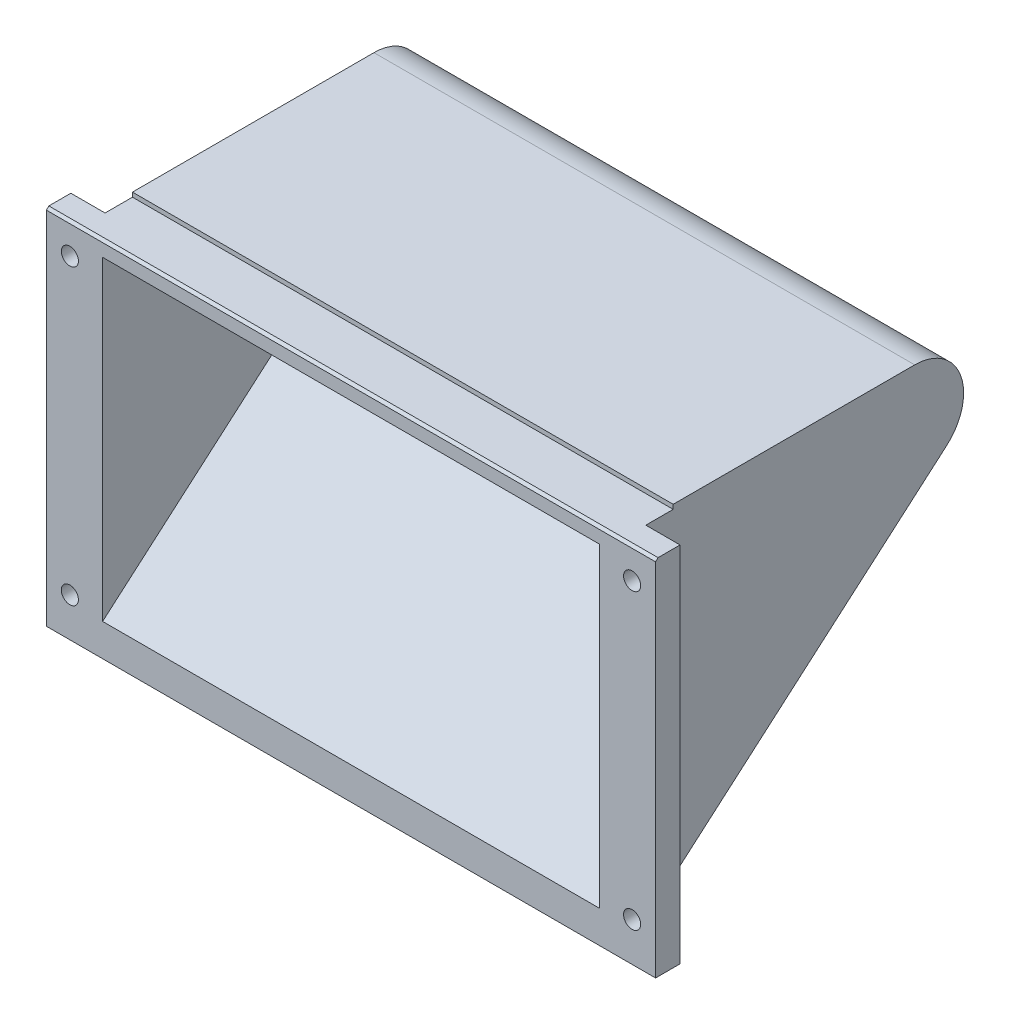
ISO-10303-21;
HEADER;
FILE_DESCRIPTION(('STEP AP214'),'2;1');
FILE_NAME('part.step','',(''),(''),'','','');
FILE_SCHEMA(('AUTOMOTIVE_DESIGN { 1 0 10303 214 1 1 1 1 }'));
ENDSEC;
DATA;
#1=APPLICATION_CONTEXT('core data for automotive mechanical design processes');
#2=APPLICATION_PROTOCOL_DEFINITION('international standard','automotive_design',2000,#1);
#3=PRODUCT_CONTEXT('',#1,'mechanical');
#4=PRODUCT('Part','Part','',(#3));
#5=PRODUCT_RELATED_PRODUCT_CATEGORY('part','',(#4));
#6=PRODUCT_DEFINITION_FORMATION('','',#4);
#7=PRODUCT_DEFINITION_CONTEXT('part definition',#1,'design');
#8=PRODUCT_DEFINITION('design','',#6,#7);
#9=PRODUCT_DEFINITION_SHAPE('','',#8);
#10=(LENGTH_UNIT() NAMED_UNIT(*) SI_UNIT(.MILLI.,.METRE.));
#11=(NAMED_UNIT(*) PLANE_ANGLE_UNIT() SI_UNIT($,.RADIAN.));
#12=(NAMED_UNIT(*) SI_UNIT($,.STERADIAN.) SOLID_ANGLE_UNIT());
#13=UNCERTAINTY_MEASURE_WITH_UNIT(LENGTH_MEASURE(1.E-05),#10,'distance_accuracy_value','');
#14=(GEOMETRIC_REPRESENTATION_CONTEXT(3) GLOBAL_UNCERTAINTY_ASSIGNED_CONTEXT((#13)) GLOBAL_UNIT_ASSIGNED_CONTEXT((#10,
#11,#12)) REPRESENTATION_CONTEXT('',''));
#15=CARTESIAN_POINT('',(0.,0.,0.));
#16=DIRECTION('',(0.,0.,1.));
#17=DIRECTION('',(1.,0.,0.));
#18=AXIS2_PLACEMENT_3D('',#15,#16,#17);
#19=CARTESIAN_POINT('',(50.8,5.,0.));
#20=DIRECTION('',(0.,-1.,0.));
#21=DIRECTION('',(0.,0.,-1.));
#22=AXIS2_PLACEMENT_3D('',#19,#20,#21);
#23=PLANE('',#22);
#24=DIRECTION('',(-1.,0.,0.));
#25=VECTOR('',#24,1.);
#26=CARTESIAN_POINT('',(-62.3,5.,-10.6));
#27=LINE('',#26,#25);
#28=CARTESIAN_POINT('',(55.3,5.,-10.6));
#29=VERTEX_POINT('',#28);
#30=CARTESIAN_POINT('',(-55.3,5.,-10.6));
#31=VERTEX_POINT('',#30);
#32=EDGE_CURVE('E192',#29,#31,#27,.T.);
#33=ORIENTED_EDGE('',*,*,#32,.F.);
#34=DIRECTION('',(0.,0.,1.));
#35=VECTOR('',#34,1.);
#36=CARTESIAN_POINT('',(55.3,5.,0.));
#37=LINE('',#36,#35);
#38=CARTESIAN_POINT('',(55.3,5.,-60.));
#39=VERTEX_POINT('',#38);
#40=EDGE_CURVE('E233',#39,#29,#37,.T.);
#41=ORIENTED_EDGE('',*,*,#40,.F.);
#42=DIRECTION('',(-1.,0.,0.));
#43=VECTOR('',#42,1.);
#44=CARTESIAN_POINT('',(50.8,5.00000000000001,-60.));
#45=LINE('',#44,#43);
#46=CARTESIAN_POINT('',(-55.3,5.,-60.));
#47=VERTEX_POINT('',#46);
#48=EDGE_CURVE('E258',#39,#47,#45,.T.);
#49=ORIENTED_EDGE('',*,*,#48,.T.);
#50=DIRECTION('',(0.,0.,1.));
#51=VECTOR('',#50,1.);
#52=CARTESIAN_POINT('',(-55.3,5.,0.));
#53=LINE('',#52,#51);
#54=EDGE_CURVE('E220',#47,#31,#53,.T.);
#55=ORIENTED_EDGE('',*,*,#54,.T.);
#56=EDGE_LOOP('',(#33,#41,#49,#55));
#57=FACE_BOUND('',#56,.T.);
#58=ADVANCED_FACE('F43',(#57),#23,.F.);
#59=CARTESIAN_POINT('',(50.8,-12.5637779895862,-66.5413502065132));
#60=DIRECTION('',(0.,0.756377798958623,0.654135020651324));
#61=DIRECTION('',(0.,-0.654135020651324,0.756377798958623));
#62=AXIS2_PLACEMENT_3D('',#59,#60,#61);
#63=PLANE('',#62);
#64=DIRECTION('',(1.,0.,0.));
#65=VECTOR('',#64,1.);
#66=CARTESIAN_POINT('',(50.8,-65.7863242405109,-5.));
#67=LINE('',#66,#65);
#68=CARTESIAN_POINT('',(-55.3,-65.7863242405109,-5.));
#69=VERTEX_POINT('',#68);
#70=CARTESIAN_POINT('',(55.3,-65.7863242405109,-5.));
#71=VERTEX_POINT('',#70);
#72=EDGE_CURVE('E214',#69,#71,#67,.T.);
#73=ORIENTED_EDGE('',*,*,#72,.F.);
#74=DIRECTION('',(0.,0.654135020651324,-0.756377798958623));
#75=VECTOR('',#74,1.);
#76=CARTESIAN_POINT('',(-55.3,-40.1107072918938,-34.6887737567738));
#77=LINE('',#76,#75);
#78=CARTESIAN_POINT('',(-55.3,-12.5637779895862,-66.5413502065132));
#79=VERTEX_POINT('',#78);
#80=EDGE_CURVE('E226',#69,#79,#77,.T.);
#81=ORIENTED_EDGE('',*,*,#80,.T.);
#82=DIRECTION('',(-1.,0.,0.));
#83=VECTOR('',#82,1.);
#84=CARTESIAN_POINT('',(50.8,-12.5637779895862,-66.5413502065132));
#85=LINE('',#84,#83);
#86=CARTESIAN_POINT('',(55.3,-12.5637779895862,-66.5413502065132));
#87=VERTEX_POINT('',#86);
#88=EDGE_CURVE('E299',#87,#79,#85,.T.);
#89=ORIENTED_EDGE('',*,*,#88,.F.);
#90=DIRECTION('',(0.,0.654135020651324,-0.756377798958623));
#91=VECTOR('',#90,1.);
#92=CARTESIAN_POINT('',(55.3,-40.1107072918938,-34.6887737567738));
#93=LINE('',#92,#91);
#94=EDGE_CURVE('E236',#71,#87,#93,.T.);
#95=ORIENTED_EDGE('',*,*,#94,.F.);
#96=EDGE_LOOP('',(#73,#81,#89,#95));
#97=FACE_BOUND('',#96,.T.);
#98=ADVANCED_FACE('F401',(#97),#63,.F.);
#99=CARTESIAN_POINT('',(55.3,0.,0.));
#100=DIRECTION('',(1.,0.,0.));
#101=DIRECTION('',(0.,0.,-1.));
#102=AXIS2_PLACEMENT_3D('',#99,#100,#101);
#103=PLANE('',#102);
#104=DIRECTION('',(0.,0.,-1.));
#105=VECTOR('',#104,1.);
#106=CARTESIAN_POINT('',(55.3,4.1,0.));
#107=LINE('',#106,#105);
#108=CARTESIAN_POINT('',(55.3,4.1,-5.));
#109=VERTEX_POINT('',#108);
#110=CARTESIAN_POINT('',(55.3,4.1,-10.6));
#111=VERTEX_POINT('',#110);
#112=EDGE_CURVE('E349',#109,#111,#107,.T.);
#113=ORIENTED_EDGE('',*,*,#112,.F.);
#114=DIRECTION('',(0.,-1.,0.));
#115=VECTOR('',#114,1.);
#116=CARTESIAN_POINT('',(55.3,0.,-5.));
#117=LINE('',#116,#115);
#118=EDGE_CURVE('E217',#109,#71,#117,.T.);
#119=ORIENTED_EDGE('',*,*,#118,.T.);
#120=ORIENTED_EDGE('',*,*,#94,.T.);
#121=CARTESIAN_POINT('',(55.3,-5.,-60.));
#122=DIRECTION('',(1.,0.,0.));
#123=DIRECTION('',(0.,0.,-1.));
#124=AXIS2_PLACEMENT_3D('',#121,#122,#123);
#125=CIRCLE('',#124,10.);
#126=EDGE_CURVE('E238',#87,#39,#125,.T.);
#127=ORIENTED_EDGE('',*,*,#126,.T.);
#128=ORIENTED_EDGE('',*,*,#40,.T.);
#129=DIRECTION('',(0.,-1.,0.));
#130=VECTOR('',#129,1.);
#131=CARTESIAN_POINT('',(55.3,0.,-10.6));
#132=LINE('',#131,#130);
#133=EDGE_CURVE('E359',#29,#111,#132,.T.);
#134=ORIENTED_EDGE('',*,*,#133,.T.);
#135=EDGE_LOOP('',(#113,#119,#120,#127,#128,#134));
#136=FACE_BOUND('',#135,.T.);
#137=ADVANCED_FACE('F407',(#136),#103,.T.);
#138=CARTESIAN_POINT('',(-55.3,0.,0.));
#139=DIRECTION('',(-1.,0.,0.));
#140=DIRECTION('',(0.,0.,-1.));
#141=AXIS2_PLACEMENT_3D('',#138,#139,#140);
#142=PLANE('',#141);
#143=DIRECTION('',(0.,0.,1.));
#144=VECTOR('',#143,1.);
#145=CARTESIAN_POINT('',(-55.3,4.1,0.));
#146=LINE('',#145,#144);
#147=CARTESIAN_POINT('',(-55.3,4.1,-10.6));
#148=VERTEX_POINT('',#147);
#149=CARTESIAN_POINT('',(-55.3,4.1,-5.));
#150=VERTEX_POINT('',#149);
#151=EDGE_CURVE('E175',#148,#150,#146,.T.);
#152=ORIENTED_EDGE('',*,*,#151,.F.);
#153=DIRECTION('',(0.,1.,0.));
#154=VECTOR('',#153,1.);
#155=CARTESIAN_POINT('',(-55.3,0.,-10.6));
#156=LINE('',#155,#154);
#157=EDGE_CURVE('E356',#148,#31,#156,.T.);
#158=ORIENTED_EDGE('',*,*,#157,.T.);
#159=ORIENTED_EDGE('',*,*,#54,.F.);
#160=CARTESIAN_POINT('',(-55.3,-5.,-60.));
#161=DIRECTION('',(1.,0.,0.));
#162=DIRECTION('',(0.,0.,-1.));
#163=AXIS2_PLACEMENT_3D('',#160,#161,#162);
#164=CIRCLE('',#163,10.);
#165=EDGE_CURVE('E223',#79,#47,#164,.T.);
#166=ORIENTED_EDGE('',*,*,#165,.F.);
#167=ORIENTED_EDGE('',*,*,#80,.F.);
#168=DIRECTION('',(0.,1.,0.));
#169=VECTOR('',#168,1.);
#170=CARTESIAN_POINT('',(-55.3,0.,-5.));
#171=LINE('',#170,#169);
#172=EDGE_CURVE('E211',#69,#150,#171,.T.);
#173=ORIENTED_EDGE('',*,*,#172,.T.);
#174=EDGE_LOOP('',(#152,#158,#159,#166,#167,#173));
#175=FACE_BOUND('',#174,.T.);
#176=ADVANCED_FACE('F426',(#175),#142,.T.);
#177=CARTESIAN_POINT('',(50.8,0.,0.));
#178=DIRECTION('',(0.,1.,0.));
#179=DIRECTION('',(0.,0.,1.));
#180=AXIS2_PLACEMENT_3D('',#177,#178,#179);
#181=PLANE('',#180);
#182=DIRECTION('',(0.,0.,-1.));
#183=VECTOR('',#182,1.);
#184=CARTESIAN_POINT('',(50.8,0.,0.));
#185=LINE('',#184,#183);
#186=CARTESIAN_POINT('',(50.8,0.,-5.461));
#187=VERTEX_POINT('',#186);
#188=CARTESIAN_POINT('',(50.8,0.,-60.));
#189=VERTEX_POINT('',#188);
#190=EDGE_CURVE('E250',#187,#189,#185,.T.);
#191=ORIENTED_EDGE('',*,*,#190,.F.);
#192=DIRECTION('',(1.,0.,0.));
#193=VECTOR('',#192,1.);
#194=CARTESIAN_POINT('',(-50.8,0.,-5.461));
#195=LINE('',#194,#193);
#196=CARTESIAN_POINT('',(-50.8,0.,-5.461));
#197=VERTEX_POINT('',#196);
#198=EDGE_CURVE('E364',#197,#187,#195,.T.);
#199=ORIENTED_EDGE('',*,*,#198,.F.);
#200=DIRECTION('',(0.,0.,-1.));
#201=VECTOR('',#200,1.);
#202=CARTESIAN_POINT('',(-50.8,0.,0.));
#203=LINE('',#202,#201);
#204=CARTESIAN_POINT('',(-50.8,0.,-60.));
#205=VERTEX_POINT('',#204);
#206=EDGE_CURVE('E241',#197,#205,#203,.T.);
#207=ORIENTED_EDGE('',*,*,#206,.T.);
#208=DIRECTION('',(-1.,0.,0.));
#209=VECTOR('',#208,1.);
#210=CARTESIAN_POINT('',(50.8,0.,-60.));
#211=LINE('',#210,#209);
#212=EDGE_CURVE('E271',#189,#205,#211,.T.);
#213=ORIENTED_EDGE('',*,*,#212,.F.);
#214=EDGE_LOOP('',(#191,#199,#207,#213));
#215=FACE_BOUND('',#214,.T.);
#216=ADVANCED_FACE('F383',(#215),#181,.F.);
#217=CARTESIAN_POINT('',(50.8,-5.,-60.));
#218=DIRECTION('',(-1.,0.,0.));
#219=DIRECTION('',(0.,0.,1.));
#220=AXIS2_PLACEMENT_3D('',#217,#218,#219);
#221=CYLINDRICAL_SURFACE('',#220,4.99999999999999);
#222=CARTESIAN_POINT('',(-50.8,-5.,-60.));
#223=DIRECTION('',(-1.,0.,0.));
#224=DIRECTION('',(0.,0.,1.));
#225=AXIS2_PLACEMENT_3D('',#222,#223,#224);
#226=CIRCLE('',#225,4.99999999999999);
#227=CARTESIAN_POINT('',(-50.8,-8.78188899479311,-63.2706751032566));
#228=VERTEX_POINT('',#227);
#229=EDGE_CURVE('E253',#205,#228,#226,.T.);
#230=ORIENTED_EDGE('',*,*,#229,.T.);
#231=DIRECTION('',(-1.,0.,0.));
#232=VECTOR('',#231,1.);
#233=CARTESIAN_POINT('',(50.8,-8.78188899479311,-63.2706751032566));
#234=LINE('',#233,#232);
#235=CARTESIAN_POINT('',(50.8,-8.78188899479311,-63.2706751032566));
#236=VERTEX_POINT('',#235);
#237=EDGE_CURVE('E295',#236,#228,#234,.T.);
#238=ORIENTED_EDGE('',*,*,#237,.F.);
#239=CARTESIAN_POINT('',(50.8,-5.,-60.));
#240=DIRECTION('',(-1.,0.,0.));
#241=DIRECTION('',(0.,0.,1.));
#242=AXIS2_PLACEMENT_3D('',#239,#240,#241);
#243=CIRCLE('',#242,4.99999999999999);
#244=EDGE_CURVE('E246',#189,#236,#243,.T.);
#245=ORIENTED_EDGE('',*,*,#244,.F.);
#246=ORIENTED_EDGE('',*,*,#212,.T.);
#247=EDGE_LOOP('',(#230,#238,#245,#246));
#248=FACE_BOUND('',#247,.T.);
#249=ADVANCED_FACE('F387',(#248),#221,.F.);
#250=CARTESIAN_POINT('',(50.8,-8.78188899479311,-63.2706751032566));
#251=DIRECTION('',(0.,-0.756377798958623,-0.654135020651324));
#252=DIRECTION('',(0.,0.654135020651325,-0.756377798958623));
#253=AXIS2_PLACEMENT_3D('',#250,#251,#252);
#254=PLANE('',#253);
#255=DIRECTION('',(0.,-0.654135020651324,0.756377798958623));
#256=VECTOR('',#255,1.);
#257=CARTESIAN_POINT('',(-50.8,-8.78188899479311,-63.2706751032566));
#258=LINE('',#257,#256);
#259=CARTESIAN_POINT('',(-50.8,-63.5,0.));
#260=VERTEX_POINT('',#259);
#261=EDGE_CURVE('E267',#228,#260,#258,.T.);
#262=ORIENTED_EDGE('',*,*,#261,.T.);
#263=DIRECTION('',(-1.,0.,0.));
#264=VECTOR('',#263,1.);
#265=CARTESIAN_POINT('',(50.8,-63.5,0.));
#266=LINE('',#265,#264);
#267=CARTESIAN_POINT('',(50.8,-63.5,0.));
#268=VERTEX_POINT('',#267);
#269=EDGE_CURVE('E292',#268,#260,#266,.T.);
#270=ORIENTED_EDGE('',*,*,#269,.F.);
#271=DIRECTION('',(0.,-0.654135020651324,0.756377798958623));
#272=VECTOR('',#271,1.);
#273=CARTESIAN_POINT('',(50.8,-8.78188899479311,-63.2706751032566));
#274=LINE('',#273,#272);
#275=EDGE_CURVE('E249',#236,#268,#274,.T.);
#276=ORIENTED_EDGE('',*,*,#275,.F.);
#277=ORIENTED_EDGE('',*,*,#237,.T.);
#278=EDGE_LOOP('',(#262,#270,#276,#277));
#279=FACE_BOUND('',#278,.T.);
#280=ADVANCED_FACE('F389',(#279),#254,.F.);
#281=CARTESIAN_POINT('',(50.8,-70.110453145087,0.));
#282=DIRECTION('',(0.,0.,-1.));
#283=DIRECTION('',(0.,1.,0.));
#284=AXIS2_PLACEMENT_3D('',#281,#282,#283);
#285=PLANE('',#284);
#286=CARTESIAN_POINT('',(57.5,-2.14599999999997,0.));
#287=DIRECTION('',(0.,0.,1.));
#288=DIRECTION('',(1.,0.,0.));
#289=AXIS2_PLACEMENT_3D('',#286,#287,#288);
#290=CIRCLE('',#289,1.75);
#291=CARTESIAN_POINT('',(59.25,-2.14599999999997,0.));
#292=VERTEX_POINT('',#291);
#293=EDGE_CURVE('E320',#292,#292,#290,.T.);
#294=ORIENTED_EDGE('',*,*,#293,.F.);
#295=EDGE_LOOP('',(#294));
#296=FACE_BOUND('',#295,.T.);
#297=CARTESIAN_POINT('',(57.5,-62.146,0.));
#298=DIRECTION('',(0.,0.,1.));
#299=DIRECTION('',(1.,0.,0.));
#300=AXIS2_PLACEMENT_3D('',#297,#298,#299);
#301=CIRCLE('',#300,1.75);
#302=CARTESIAN_POINT('',(59.25,-62.146,0.));
#303=VERTEX_POINT('',#302);
#304=EDGE_CURVE('E317',#303,#303,#301,.T.);
#305=ORIENTED_EDGE('',*,*,#304,.F.);
#306=EDGE_LOOP('',(#305));
#307=FACE_BOUND('',#306,.T.);
#308=CARTESIAN_POINT('',(-57.5,-62.146,0.));
#309=DIRECTION('',(0.,0.,1.));
#310=DIRECTION('',(1.,0.,0.));
#311=AXIS2_PLACEMENT_3D('',#308,#309,#310);
#312=CIRCLE('',#311,1.75);
#313=CARTESIAN_POINT('',(-55.75,-62.146,0.));
#314=VERTEX_POINT('',#313);
#315=EDGE_CURVE('E314',#314,#314,#312,.T.);
#316=ORIENTED_EDGE('',*,*,#315,.F.);
#317=EDGE_LOOP('',(#316));
#318=FACE_BOUND('',#317,.T.);
#319=CARTESIAN_POINT('',(-57.5,-2.14599999999998,0.));
#320=DIRECTION('',(0.,0.,1.));
#321=DIRECTION('',(1.,0.,0.));
#322=AXIS2_PLACEMENT_3D('',#319,#320,#321);
#323=CIRCLE('',#322,1.75);
#324=CARTESIAN_POINT('',(-55.75,-2.14599999999998,0.));
#325=VERTEX_POINT('',#324);
#326=EDGE_CURVE('E310',#325,#325,#323,.T.);
#327=ORIENTED_EDGE('',*,*,#326,.F.);
#328=EDGE_LOOP('',(#327));
#329=FACE_BOUND('',#328,.T.);
#330=DIRECTION('',(0.,-1.,0.));
#331=VECTOR('',#330,1.);
#332=CARTESIAN_POINT('',(-50.8,0.,0.));
#333=LINE('',#332,#331);
#334=CARTESIAN_POINT('',(-50.8,1.,0.));
#335=VERTEX_POINT('',#334);
#336=EDGE_CURVE('E219',#335,#260,#333,.T.);
#337=ORIENTED_EDGE('',*,*,#336,.F.);
#338=DIRECTION('',(1.,0.,0.));
#339=VECTOR('',#338,1.);
#340=CARTESIAN_POINT('',(50.8,1.,0.));
#341=LINE('',#340,#339);
#342=CARTESIAN_POINT('',(50.8,1.,0.));
#343=VERTEX_POINT('',#342);
#344=EDGE_CURVE('E275',#335,#343,#341,.T.);
#345=ORIENTED_EDGE('',*,*,#344,.T.);
#346=DIRECTION('',(0.,-1.,0.));
#347=VECTOR('',#346,1.);
#348=CARTESIAN_POINT('',(50.8,0.,0.));
#349=LINE('',#348,#347);
#350=EDGE_CURVE('E228',#343,#268,#349,.T.);
#351=ORIENTED_EDGE('',*,*,#350,.T.);
#352=ORIENTED_EDGE('',*,*,#269,.T.);
#353=EDGE_LOOP('',(#337,#345,#351,#352));
#354=FACE_BOUND('',#353,.T.);
#355=DIRECTION('',(0.,-1.,0.));
#356=VECTOR('',#355,1.);
#357=CARTESIAN_POINT('',(62.3,0.,0.));
#358=LINE('',#357,#356);
#359=CARTESIAN_POINT('',(62.3,3.60000000000001,0.));
#360=VERTEX_POINT('',#359);
#361=CARTESIAN_POINT('',(62.3,-70.110453145087,0.));
#362=VERTEX_POINT('',#361);
#363=EDGE_CURVE('E206',#360,#362,#358,.T.);
#364=ORIENTED_EDGE('',*,*,#363,.F.);
#365=DIRECTION('',(-1.,0.,0.));
#366=VECTOR('',#365,1.);
#367=CARTESIAN_POINT('',(50.8,3.60000000000001,0.));
#368=LINE('',#367,#366);
#369=CARTESIAN_POINT('',(-62.3,3.60000000000001,0.));
#370=VERTEX_POINT('',#369);
#371=EDGE_CURVE('E278',#360,#370,#368,.T.);
#372=ORIENTED_EDGE('',*,*,#371,.T.);
#373=DIRECTION('',(0.,1.,0.));
#374=VECTOR('',#373,1.);
#375=CARTESIAN_POINT('',(-62.3,0.,0.));
#376=LINE('',#375,#374);
#377=CARTESIAN_POINT('',(-62.3,-70.110453145087,0.));
#378=VERTEX_POINT('',#377);
#379=EDGE_CURVE('E208',#378,#370,#376,.T.);
#380=ORIENTED_EDGE('',*,*,#379,.F.);
#381=DIRECTION('',(-1.,0.,0.));
#382=VECTOR('',#381,1.);
#383=CARTESIAN_POINT('',(50.8,-70.110453145087,0.));
#384=LINE('',#383,#382);
#385=EDGE_CURVE('E296',#362,#378,#384,.T.);
#386=ORIENTED_EDGE('',*,*,#385,.F.);
#387=EDGE_LOOP('',(#364,#372,#380,#386));
#388=FACE_BOUND('',#387,.T.);
#389=ADVANCED_FACE('F289',(#296,#307,#318,#329,#354,#388),#285,.F.);
#390=CARTESIAN_POINT('',(50.8,-5.,-60.));
#391=DIRECTION('',(-1.,0.,0.));
#392=DIRECTION('',(0.,0.,1.));
#393=AXIS2_PLACEMENT_3D('',#390,#391,#392);
#394=CYLINDRICAL_SURFACE('',#393,10.);
#395=ORIENTED_EDGE('',*,*,#88,.T.);
#396=ORIENTED_EDGE('',*,*,#165,.T.);
#397=ORIENTED_EDGE('',*,*,#48,.F.);
#398=ORIENTED_EDGE('',*,*,#126,.F.);
#399=EDGE_LOOP('',(#395,#396,#397,#398));
#400=FACE_BOUND('',#399,.T.);
#401=ADVANCED_FACE('F396',(#400),#394,.T.);
#402=CARTESIAN_POINT('',(50.8,0.,0.));
#403=DIRECTION('',(1.,0.,0.));
#404=DIRECTION('',(0.,0.,-1.));
#405=AXIS2_PLACEMENT_3D('',#402,#403,#404);
#406=PLANE('',#405);
#407=ORIENTED_EDGE('',*,*,#350,.F.);
#408=DIRECTION('',(0.,0.707106781186548,0.707106781186547));
#409=VECTOR('',#408,1.);
#410=CARTESIAN_POINT('',(50.8,0.5,-0.500000000000001));
#411=LINE('',#410,#409);
#412=CARTESIAN_POINT('',(50.8,0.5,-0.500000000000001));
#413=VERTEX_POINT('',#412);
#414=EDGE_CURVE('E13',#343,#413,#411,.F.);
#415=ORIENTED_EDGE('',*,*,#414,.T.);
#416=DIRECTION('',(0.,0.,1.));
#417=VECTOR('',#416,1.);
#418=CARTESIAN_POINT('',(50.8,0.5,-5.461));
#419=LINE('',#418,#417);
#420=CARTESIAN_POINT('',(50.8,0.5,-5.461));
#421=VERTEX_POINT('',#420);
#422=EDGE_CURVE('E329',#421,#413,#419,.T.);
#423=ORIENTED_EDGE('',*,*,#422,.F.);
#424=DIRECTION('',(0.,1.,0.));
#425=VECTOR('',#424,1.);
#426=CARTESIAN_POINT('',(50.8,0.,-5.461));
#427=LINE('',#426,#425);
#428=EDGE_CURVE('E367',#187,#421,#427,.T.);
#429=ORIENTED_EDGE('',*,*,#428,.F.);
#430=ORIENTED_EDGE('',*,*,#190,.T.);
#431=ORIENTED_EDGE('',*,*,#244,.T.);
#432=ORIENTED_EDGE('',*,*,#275,.T.);
#433=EDGE_LOOP('',(#407,#415,#423,#429,#430,#431,#432));
#434=FACE_BOUND('',#433,.T.);
#435=ADVANCED_FACE('F376',(#434),#406,.F.);
#436=CARTESIAN_POINT('',(-50.8,0.,0.));
#437=DIRECTION('',(-1.,0.,0.));
#438=DIRECTION('',(0.,0.,-1.));
#439=AXIS2_PLACEMENT_3D('',#436,#437,#438);
#440=PLANE('',#439);
#441=ORIENTED_EDGE('',*,*,#336,.T.);
#442=ORIENTED_EDGE('',*,*,#261,.F.);
#443=ORIENTED_EDGE('',*,*,#229,.F.);
#444=ORIENTED_EDGE('',*,*,#206,.F.);
#445=DIRECTION('',(0.,-1.,0.));
#446=VECTOR('',#445,1.);
#447=CARTESIAN_POINT('',(-50.8,0.,-5.461));
#448=LINE('',#447,#446);
#449=CARTESIAN_POINT('',(-50.8,0.5,-5.461));
#450=VERTEX_POINT('',#449);
#451=EDGE_CURVE('E362',#450,#197,#448,.T.);
#452=ORIENTED_EDGE('',*,*,#451,.F.);
#453=DIRECTION('',(0.,0.,1.));
#454=VECTOR('',#453,1.);
#455=CARTESIAN_POINT('',(-50.8,0.5,-5.461));
#456=LINE('',#455,#454);
#457=CARTESIAN_POINT('',(-50.8,0.5,-0.500000000000001));
#458=VERTEX_POINT('',#457);
#459=EDGE_CURVE('E287',#450,#458,#456,.T.);
#460=ORIENTED_EDGE('',*,*,#459,.T.);
#461=DIRECTION('',(0.,-0.707106781186548,-0.707106781186547));
#462=VECTOR('',#461,1.);
#463=CARTESIAN_POINT('',(-50.8,0.5,-0.500000000000001));
#464=LINE('',#463,#462);
#465=EDGE_CURVE('E51',#458,#335,#464,.F.);
#466=ORIENTED_EDGE('',*,*,#465,.T.);
#467=EDGE_LOOP('',(#441,#442,#443,#444,#452,#460,#466));
#468=FACE_BOUND('',#467,.T.);
#469=ADVANCED_FACE('F284',(#468),#440,.F.);
#470=CARTESIAN_POINT('',(0.,-70.110453145087,-5.));
#471=DIRECTION('',(0.,-1.,0.));
#472=DIRECTION('',(0.,0.,-1.));
#473=AXIS2_PLACEMENT_3D('',#470,#471,#472);
#474=PLANE('',#473);
#475=ORIENTED_EDGE('',*,*,#385,.T.);
#476=DIRECTION('',(0.,0.,1.));
#477=VECTOR('',#476,1.);
#478=CARTESIAN_POINT('',(-62.3,-70.110453145087,-5.));
#479=LINE('',#478,#477);
#480=CARTESIAN_POINT('',(-62.3,-70.110453145087,-5.));
#481=VERTEX_POINT('',#480);
#482=EDGE_CURVE('E201',#481,#378,#479,.T.);
#483=ORIENTED_EDGE('',*,*,#482,.F.);
#484=DIRECTION('',(1.,0.,0.));
#485=VECTOR('',#484,1.);
#486=CARTESIAN_POINT('',(0.,-70.110453145087,-5.));
#487=LINE('',#486,#485);
#488=CARTESIAN_POINT('',(62.3,-70.110453145087,-5.));
#489=VERTEX_POINT('',#488);
#490=EDGE_CURVE('E196',#481,#489,#487,.T.);
#491=ORIENTED_EDGE('',*,*,#490,.T.);
#492=DIRECTION('',(0.,0.,1.));
#493=VECTOR('',#492,1.);
#494=CARTESIAN_POINT('',(62.3,-70.110453145087,-5.));
#495=LINE('',#494,#493);
#496=EDGE_CURVE('E197',#489,#362,#495,.T.);
#497=ORIENTED_EDGE('',*,*,#496,.T.);
#498=EDGE_LOOP('',(#475,#483,#491,#497));
#499=FACE_BOUND('',#498,.T.);
#500=ADVANCED_FACE('F337',(#499),#474,.T.);
#501=CARTESIAN_POINT('',(-62.3,0.,-5.));
#502=DIRECTION('',(1.,0.,0.));
#503=DIRECTION('',(0.,1.,0.));
#504=AXIS2_PLACEMENT_3D('',#501,#502,#503);
#505=PLANE('',#504);
#506=ORIENTED_EDGE('',*,*,#379,.T.);
#507=DIRECTION('',(0.,-0.707106781186544,0.707106781186551));
#508=VECTOR('',#507,1.);
#509=CARTESIAN_POINT('',(-62.3,4.1,-0.5));
#510=LINE('',#509,#508);
#511=CARTESIAN_POINT('',(-62.3,4.1,-0.5));
#512=VERTEX_POINT('',#511);
#513=EDGE_CURVE('E190',#370,#512,#510,.F.);
#514=ORIENTED_EDGE('',*,*,#513,.T.);
#515=DIRECTION('',(0.,0.,1.));
#516=VECTOR('',#515,1.);
#517=CARTESIAN_POINT('',(-62.3,4.1,-10.6));
#518=LINE('',#517,#516);
#519=CARTESIAN_POINT('',(-62.3,4.1,-5.));
#520=VERTEX_POINT('',#519);
#521=EDGE_CURVE('E171',#520,#512,#518,.T.);
#522=ORIENTED_EDGE('',*,*,#521,.F.);
#523=DIRECTION('',(0.,1.,0.));
#524=VECTOR('',#523,1.);
#525=CARTESIAN_POINT('',(-62.3,0.,-5.));
#526=LINE('',#525,#524);
#527=EDGE_CURVE('E187',#481,#520,#526,.T.);
#528=ORIENTED_EDGE('',*,*,#527,.F.);
#529=ORIENTED_EDGE('',*,*,#482,.T.);
#530=EDGE_LOOP('',(#506,#514,#522,#528,#529));
#531=FACE_BOUND('',#530,.T.);
#532=ADVANCED_FACE('F185',(#531),#505,.F.);
#533=CARTESIAN_POINT('',(62.3,0.,-5.));
#534=DIRECTION('',(-1.,0.,0.));
#535=DIRECTION('',(0.,0.,1.));
#536=AXIS2_PLACEMENT_3D('',#533,#534,#535);
#537=PLANE('',#536);
#538=DIRECTION('',(0.,0.,1.));
#539=VECTOR('',#538,1.);
#540=CARTESIAN_POINT('',(62.3,4.1,-10.6));
#541=LINE('',#540,#539);
#542=CARTESIAN_POINT('',(62.3,4.1,-5.));
#543=VERTEX_POINT('',#542);
#544=CARTESIAN_POINT('',(62.3,4.1,-0.5));
#545=VERTEX_POINT('',#544);
#546=EDGE_CURVE('E191',#543,#545,#541,.T.);
#547=ORIENTED_EDGE('',*,*,#546,.T.);
#548=DIRECTION('',(0.,0.707106781186544,-0.707106781186551));
#549=VECTOR('',#548,1.);
#550=CARTESIAN_POINT('',(62.3,4.1,-0.5));
#551=LINE('',#550,#549);
#552=EDGE_CURVE('E273',#545,#360,#551,.F.);
#553=ORIENTED_EDGE('',*,*,#552,.T.);
#554=ORIENTED_EDGE('',*,*,#363,.T.);
#555=ORIENTED_EDGE('',*,*,#496,.F.);
#556=DIRECTION('',(0.,-1.,0.));
#557=VECTOR('',#556,1.);
#558=CARTESIAN_POINT('',(62.3,0.,-5.));
#559=LINE('',#558,#557);
#560=EDGE_CURVE('E198',#543,#489,#559,.T.);
#561=ORIENTED_EDGE('',*,*,#560,.F.);
#562=EDGE_LOOP('',(#547,#553,#554,#555,#561));
#563=FACE_BOUND('',#562,.T.);
#564=ADVANCED_FACE('F348',(#563),#537,.F.);
#565=CARTESIAN_POINT('',(0.,0.,-5.));
#566=DIRECTION('',(0.,0.,1.));
#567=DIRECTION('',(1.,0.,0.));
#568=AXIS2_PLACEMENT_3D('',#565,#566,#567);
#569=PLANE('',#568);
#570=CARTESIAN_POINT('',(57.5,-2.14599999999997,-5.));
#571=DIRECTION('',(0.,0.,1.));
#572=DIRECTION('',(1.,0.,0.));
#573=AXIS2_PLACEMENT_3D('',#570,#571,#572);
#574=CIRCLE('',#573,1.75);
#575=CARTESIAN_POINT('',(59.25,-2.14599999999997,-5.));
#576=VERTEX_POINT('',#575);
#577=EDGE_CURVE('E318',#576,#576,#574,.T.);
#578=ORIENTED_EDGE('',*,*,#577,.T.);
#579=EDGE_LOOP('',(#578));
#580=FACE_BOUND('',#579,.T.);
#581=CARTESIAN_POINT('',(57.5,-62.146,-5.));
#582=DIRECTION('',(0.,0.,1.));
#583=DIRECTION('',(1.,0.,0.));
#584=AXIS2_PLACEMENT_3D('',#581,#582,#583);
#585=CIRCLE('',#584,1.75);
#586=CARTESIAN_POINT('',(59.25,-62.146,-5.));
#587=VERTEX_POINT('',#586);
#588=EDGE_CURVE('E315',#587,#587,#585,.T.);
#589=ORIENTED_EDGE('',*,*,#588,.T.);
#590=EDGE_LOOP('',(#589));
#591=FACE_BOUND('',#590,.T.);
#592=CARTESIAN_POINT('',(-57.5,-62.146,-5.));
#593=DIRECTION('',(0.,0.,1.));
#594=DIRECTION('',(1.,0.,0.));
#595=AXIS2_PLACEMENT_3D('',#592,#593,#594);
#596=CIRCLE('',#595,1.75);
#597=CARTESIAN_POINT('',(-55.75,-62.146,-5.));
#598=VERTEX_POINT('',#597);
#599=EDGE_CURVE('E311',#598,#598,#596,.T.);
#600=ORIENTED_EDGE('',*,*,#599,.T.);
#601=EDGE_LOOP('',(#600));
#602=FACE_BOUND('',#601,.T.);
#603=CARTESIAN_POINT('',(-57.5,-2.14599999999998,-5.));
#604=DIRECTION('',(0.,0.,1.));
#605=DIRECTION('',(1.,0.,0.));
#606=AXIS2_PLACEMENT_3D('',#603,#604,#605);
#607=CIRCLE('',#606,1.75);
#608=CARTESIAN_POINT('',(-55.75,-2.14599999999998,-5.));
#609=VERTEX_POINT('',#608);
#610=EDGE_CURVE('E209',#609,#609,#607,.T.);
#611=ORIENTED_EDGE('',*,*,#610,.T.);
#612=EDGE_LOOP('',(#611));
#613=FACE_BOUND('',#612,.T.);
#614=ORIENTED_EDGE('',*,*,#527,.T.);
#615=DIRECTION('',(1.,0.,0.));
#616=VECTOR('',#615,1.);
#617=CARTESIAN_POINT('',(0.,4.1,-5.));
#618=LINE('',#617,#616);
#619=EDGE_CURVE('E167',#520,#150,#618,.T.);
#620=ORIENTED_EDGE('',*,*,#619,.T.);
#621=ORIENTED_EDGE('',*,*,#172,.F.);
#622=ORIENTED_EDGE('',*,*,#72,.T.);
#623=ORIENTED_EDGE('',*,*,#118,.F.);
#624=EDGE_CURVE('E180',#109,#543,#618,.T.);
#625=ORIENTED_EDGE('',*,*,#624,.T.);
#626=ORIENTED_EDGE('',*,*,#560,.T.);
#627=ORIENTED_EDGE('',*,*,#490,.F.);
#628=EDGE_LOOP('',(#614,#620,#621,#622,#623,#625,#626,#627));
#629=FACE_BOUND('',#628,.T.);
#630=ADVANCED_FACE('F194',(#580,#591,#602,#613,#629),#569,.F.);
#631=CARTESIAN_POINT('',(-57.5,-2.14599999999998,-18.75));
#632=DIRECTION('',(0.,0.,1.));
#633=DIRECTION('',(1.,0.,0.));
#634=AXIS2_PLACEMENT_3D('',#631,#632,#633);
#635=CYLINDRICAL_SURFACE('',#634,1.75);
#636=ORIENTED_EDGE('',*,*,#326,.T.);
#637=EDGE_LOOP('',(#636));
#638=FACE_BOUND('',#637,.T.);
#639=ORIENTED_EDGE('',*,*,#610,.F.);
#640=EDGE_LOOP('',(#639));
#641=FACE_BOUND('',#640,.T.);
#642=ADVANCED_FACE('F458',(#638,#641),#635,.F.);
#643=CARTESIAN_POINT('',(-57.5,-62.146,-18.75));
#644=DIRECTION('',(0.,0.,1.));
#645=DIRECTION('',(1.,0.,0.));
#646=AXIS2_PLACEMENT_3D('',#643,#644,#645);
#647=CYLINDRICAL_SURFACE('',#646,1.75);
#648=ORIENTED_EDGE('',*,*,#315,.T.);
#649=EDGE_LOOP('',(#648));
#650=FACE_BOUND('',#649,.T.);
#651=ORIENTED_EDGE('',*,*,#599,.F.);
#652=EDGE_LOOP('',(#651));
#653=FACE_BOUND('',#652,.T.);
#654=ADVANCED_FACE('F454',(#650,#653),#647,.F.);
#655=CARTESIAN_POINT('',(57.5,-62.146,-18.75));
#656=DIRECTION('',(0.,0.,1.));
#657=DIRECTION('',(1.,0.,0.));
#658=AXIS2_PLACEMENT_3D('',#655,#656,#657);
#659=CYLINDRICAL_SURFACE('',#658,1.75);
#660=ORIENTED_EDGE('',*,*,#304,.T.);
#661=EDGE_LOOP('',(#660));
#662=FACE_BOUND('',#661,.T.);
#663=ORIENTED_EDGE('',*,*,#588,.F.);
#664=EDGE_LOOP('',(#663));
#665=FACE_BOUND('',#664,.T.);
#666=ADVANCED_FACE('F451',(#662,#665),#659,.F.);
#667=CARTESIAN_POINT('',(57.5,-2.14599999999997,-18.75));
#668=DIRECTION('',(0.,0.,1.));
#669=DIRECTION('',(1.,0.,0.));
#670=AXIS2_PLACEMENT_3D('',#667,#668,#669);
#671=CYLINDRICAL_SURFACE('',#670,1.75);
#672=ORIENTED_EDGE('',*,*,#293,.T.);
#673=EDGE_LOOP('',(#672));
#674=FACE_BOUND('',#673,.T.);
#675=ORIENTED_EDGE('',*,*,#577,.F.);
#676=EDGE_LOOP('',(#675));
#677=FACE_BOUND('',#676,.T.);
#678=ADVANCED_FACE('F448',(#674,#677),#671,.F.);
#679=CARTESIAN_POINT('',(-50.8,0.5,-5.461));
#680=DIRECTION('',(0.,1.,0.));
#681=DIRECTION('',(0.,0.,1.));
#682=AXIS2_PLACEMENT_3D('',#679,#680,#681);
#683=PLANE('',#682);
#684=ORIENTED_EDGE('',*,*,#422,.T.);
#685=DIRECTION('',(-1.,0.,0.));
#686=VECTOR('',#685,1.);
#687=CARTESIAN_POINT('',(-50.8,0.5,-0.500000000000001));
#688=LINE('',#687,#686);
#689=EDGE_CURVE('E281',#413,#458,#688,.T.);
#690=ORIENTED_EDGE('',*,*,#689,.T.);
#691=ORIENTED_EDGE('',*,*,#459,.F.);
#692=DIRECTION('',(-1.,0.,0.));
#693=VECTOR('',#692,1.);
#694=CARTESIAN_POINT('',(-50.8,0.5,-5.461));
#695=LINE('',#694,#693);
#696=EDGE_CURVE('E370',#421,#450,#695,.T.);
#697=ORIENTED_EDGE('',*,*,#696,.F.);
#698=EDGE_LOOP('',(#684,#690,#691,#697));
#699=FACE_BOUND('',#698,.T.);
#700=ADVANCED_FACE('F375',(#699),#683,.F.);
#701=CARTESIAN_POINT('',(0.,0.,-5.461));
#702=DIRECTION('',(0.,0.,-1.));
#703=DIRECTION('',(-1.,0.,0.));
#704=AXIS2_PLACEMENT_3D('',#701,#702,#703);
#705=PLANE('',#704);
#706=ORIENTED_EDGE('',*,*,#451,.T.);
#707=ORIENTED_EDGE('',*,*,#198,.T.);
#708=ORIENTED_EDGE('',*,*,#428,.T.);
#709=ORIENTED_EDGE('',*,*,#696,.T.);
#710=EDGE_LOOP('',(#706,#707,#708,#709));
#711=FACE_BOUND('',#710,.T.);
#712=ADVANCED_FACE('F377',(#711),#705,.F.);
#713=CARTESIAN_POINT('',(-62.3,4.1,-10.6));
#714=DIRECTION('',(0.,-1.,0.));
#715=DIRECTION('',(0.,0.,-1.));
#716=AXIS2_PLACEMENT_3D('',#713,#714,#715);
#717=PLANE('',#716);
#718=ORIENTED_EDGE('',*,*,#521,.T.);
#719=DIRECTION('',(1.,0.,0.));
#720=VECTOR('',#719,1.);
#721=CARTESIAN_POINT('',(-62.3,4.1,-0.5));
#722=LINE('',#721,#720);
#723=EDGE_CURVE('E179',#512,#545,#722,.T.);
#724=ORIENTED_EDGE('',*,*,#723,.T.);
#725=ORIENTED_EDGE('',*,*,#546,.F.);
#726=ORIENTED_EDGE('',*,*,#624,.F.);
#727=ORIENTED_EDGE('',*,*,#112,.T.);
#728=DIRECTION('',(1.,0.,0.));
#729=VECTOR('',#728,1.);
#730=CARTESIAN_POINT('',(-62.3,4.1,-10.6));
#731=LINE('',#730,#729);
#732=EDGE_CURVE('E435',#148,#111,#731,.T.);
#733=ORIENTED_EDGE('',*,*,#732,.F.);
#734=ORIENTED_EDGE('',*,*,#151,.T.);
#735=ORIENTED_EDGE('',*,*,#619,.F.);
#736=EDGE_LOOP('',(#718,#724,#725,#726,#727,#733,#734,#735));
#737=FACE_BOUND('',#736,.T.);
#738=ADVANCED_FACE('F169',(#737),#717,.F.);
#739=CARTESIAN_POINT('',(0.,0.,-10.6));
#740=DIRECTION('',(0.,0.,1.));
#741=DIRECTION('',(1.,0.,0.));
#742=AXIS2_PLACEMENT_3D('',#739,#740,#741);
#743=PLANE('',#742);
#744=ORIENTED_EDGE('',*,*,#32,.T.);
#745=ORIENTED_EDGE('',*,*,#157,.F.);
#746=ORIENTED_EDGE('',*,*,#732,.T.);
#747=ORIENTED_EDGE('',*,*,#133,.F.);
#748=EDGE_LOOP('',(#744,#745,#746,#747));
#749=FACE_BOUND('',#748,.T.);
#750=ADVANCED_FACE('F434',(#749),#743,.T.);
#751=CARTESIAN_POINT('',(-62.3,4.1,-0.5));
#752=DIRECTION('',(0.,-0.707106781186551,-0.707106781186544));
#753=DIRECTION('',(1.,0.,0.));
#754=AXIS2_PLACEMENT_3D('',#751,#752,#753);
#755=PLANE('',#754);
#756=ORIENTED_EDGE('',*,*,#513,.F.);
#757=ORIENTED_EDGE('',*,*,#371,.F.);
#758=ORIENTED_EDGE('',*,*,#552,.F.);
#759=ORIENTED_EDGE('',*,*,#723,.F.);
#760=EDGE_LOOP('',(#756,#757,#758,#759));
#761=FACE_BOUND('',#760,.T.);
#762=ADVANCED_FACE('F344',(#761),#755,.F.);
#763=CARTESIAN_POINT('',(-50.8,0.5,-0.500000000000001));
#764=DIRECTION('',(0.,0.707106781186547,-0.707106781186548));
#765=DIRECTION('',(-1.,0.,0.));
#766=AXIS2_PLACEMENT_3D('',#763,#764,#765);
#767=PLANE('',#766);
#768=ORIENTED_EDGE('',*,*,#414,.F.);
#769=ORIENTED_EDGE('',*,*,#344,.F.);
#770=ORIENTED_EDGE('',*,*,#465,.F.);
#771=ORIENTED_EDGE('',*,*,#689,.F.);
#772=EDGE_LOOP('',(#768,#769,#770,#771));
#773=FACE_BOUND('',#772,.T.);
#774=ADVANCED_FACE('F45',(#773),#767,.F.);
#775=CLOSED_SHELL('',(#58,#98,#137,#176,#216,#249,#280,#389,#401,#435,#469,#500,#532,#564,#630,
#642,#654,#666,#678,#700,#712,#738,#750,#762,#774));
#776=MANIFOLD_SOLID_BREP('B2',#775);
#777=ADVANCED_BREP_SHAPE_REPRESENTATION('',(#18,#776),#14);
#778=SHAPE_DEFINITION_REPRESENTATION(#9,#777);
ENDSEC;
END-ISO-10303-21;
